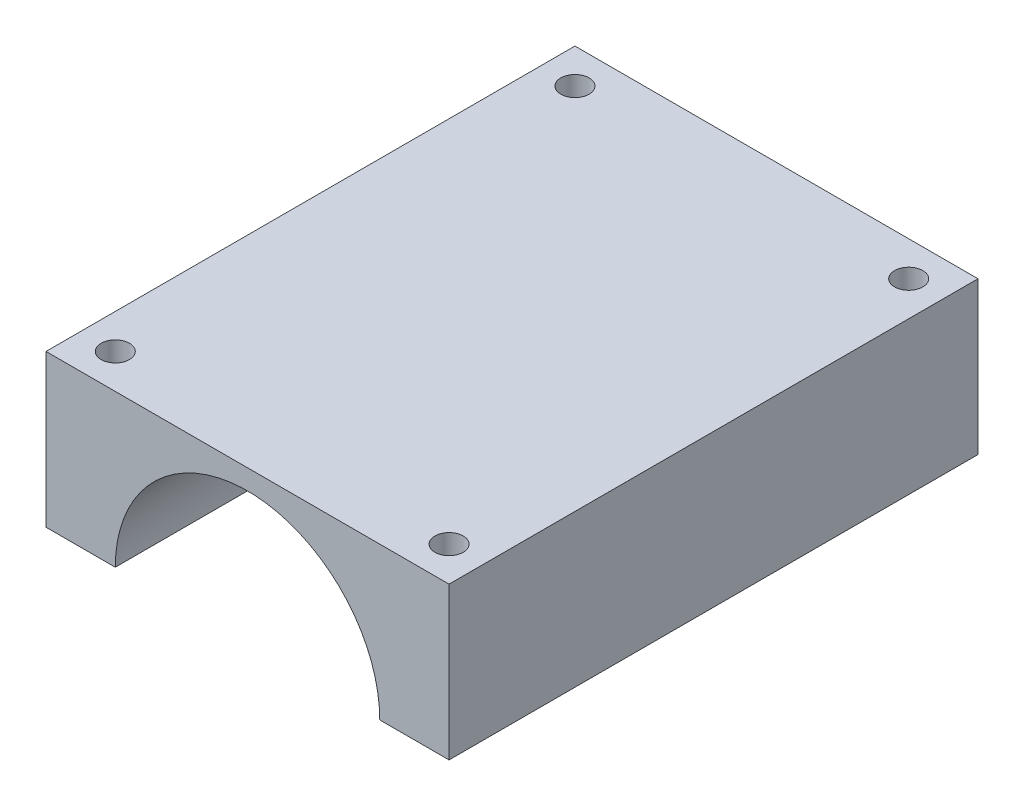
ISO-10303-21;
HEADER;
FILE_DESCRIPTION(('STEP AP214'),'2;1');
FILE_NAME('part.step','',(''),(''),'','','');
FILE_SCHEMA(('AUTOMOTIVE_DESIGN { 1 0 10303 214 1 1 1 1 }'));
ENDSEC;
DATA;
#1=APPLICATION_CONTEXT('core data for automotive mechanical design processes');
#2=APPLICATION_PROTOCOL_DEFINITION('international standard','automotive_design',2000,#1);
#3=PRODUCT_CONTEXT('',#1,'mechanical');
#4=PRODUCT('Part','Part','',(#3));
#5=PRODUCT_RELATED_PRODUCT_CATEGORY('part','',(#4));
#6=PRODUCT_DEFINITION_FORMATION('','',#4);
#7=PRODUCT_DEFINITION_CONTEXT('part definition',#1,'design');
#8=PRODUCT_DEFINITION('design','',#6,#7);
#9=PRODUCT_DEFINITION_SHAPE('','',#8);
#10=(LENGTH_UNIT() NAMED_UNIT(*) SI_UNIT(.MILLI.,.METRE.));
#11=(NAMED_UNIT(*) PLANE_ANGLE_UNIT() SI_UNIT($,.RADIAN.));
#12=(NAMED_UNIT(*) SI_UNIT($,.STERADIAN.) SOLID_ANGLE_UNIT());
#13=UNCERTAINTY_MEASURE_WITH_UNIT(LENGTH_MEASURE(1.E-05),#10,'distance_accuracy_value','');
#14=(GEOMETRIC_REPRESENTATION_CONTEXT(3) GLOBAL_UNCERTAINTY_ASSIGNED_CONTEXT((#13)) GLOBAL_UNIT_ASSIGNED_CONTEXT((#10,
#11,#12)) REPRESENTATION_CONTEXT('',''));
#15=CARTESIAN_POINT('',(0.,0.,0.));
#16=DIRECTION('',(0.,0.,1.));
#17=DIRECTION('',(1.,0.,0.));
#18=AXIS2_PLACEMENT_3D('',#15,#16,#17);
#19=CARTESIAN_POINT('',(0.,0.,0.));
#20=DIRECTION('',(0.,1.,0.));
#21=DIRECTION('',(0.,0.,1.));
#22=AXIS2_PLACEMENT_3D('',#19,#20,#21);
#23=PLANE('',#22);
#24=CARTESIAN_POINT('',(-23.6625,0.,-32.5875));
#25=DIRECTION('',(0.,1.,0.));
#26=DIRECTION('',(0.,0.,1.));
#27=AXIS2_PLACEMENT_3D('',#24,#25,#26);
#28=CIRCLE('',#27,2.008);
#29=CARTESIAN_POINT('',(-23.6625,0.,-30.5795));
#30=VERTEX_POINT('',#29);
#31=EDGE_CURVE('E180',#30,#30,#28,.T.);
#32=ORIENTED_EDGE('',*,*,#31,.T.);
#33=EDGE_LOOP('',(#32));
#34=FACE_BOUND('',#33,.T.);
#35=CARTESIAN_POINT('',(-23.6625,0.,32.5875));
#36=DIRECTION('',(0.,1.,0.));
#37=DIRECTION('',(0.,0.,1.));
#38=AXIS2_PLACEMENT_3D('',#35,#36,#37);
#39=CIRCLE('',#38,2.008);
#40=CARTESIAN_POINT('',(-23.6625,0.,34.5955));
#41=VERTEX_POINT('',#40);
#42=EDGE_CURVE('E109',#41,#41,#39,.F.);
#43=ORIENTED_EDGE('',*,*,#42,.F.);
#44=EDGE_LOOP('',(#43));
#45=FACE_BOUND('',#44,.T.);
#46=DIRECTION('',(-1.,0.,0.));
#47=VECTOR('',#46,1.);
#48=CARTESIAN_POINT('',(-28.575,0.,-37.5));
#49=LINE('',#48,#47);
#50=CARTESIAN_POINT('',(-18.75,0.,-37.5));
#51=VERTEX_POINT('',#50);
#52=CARTESIAN_POINT('',(-28.575,0.,-37.5));
#53=VERTEX_POINT('',#52);
#54=EDGE_CURVE('E81',#51,#53,#49,.T.);
#55=ORIENTED_EDGE('',*,*,#54,.F.);
#56=DIRECTION('',(0.,0.,1.));
#57=VECTOR('',#56,1.);
#58=CARTESIAN_POINT('',(-18.75,0.,-37.501));
#59=LINE('',#58,#57);
#60=CARTESIAN_POINT('',(-18.75,0.,37.5));
#61=VERTEX_POINT('',#60);
#62=EDGE_CURVE('E96',#51,#61,#59,.T.);
#63=ORIENTED_EDGE('',*,*,#62,.T.);
#64=DIRECTION('',(1.,0.,0.));
#65=VECTOR('',#64,1.);
#66=CARTESIAN_POINT('',(-28.575,0.,37.5));
#67=LINE('',#66,#65);
#68=CARTESIAN_POINT('',(-28.575,0.,37.5));
#69=VERTEX_POINT('',#68);
#70=EDGE_CURVE('E117',#69,#61,#67,.T.);
#71=ORIENTED_EDGE('',*,*,#70,.F.);
#72=DIRECTION('',(0.,0.,1.));
#73=VECTOR('',#72,1.);
#74=CARTESIAN_POINT('',(-28.575,0.,-37.5));
#75=LINE('',#74,#73);
#76=EDGE_CURVE('E113',#53,#69,#75,.T.);
#77=ORIENTED_EDGE('',*,*,#76,.F.);
#78=EDGE_LOOP('',(#55,#63,#71,#77));
#79=FACE_BOUND('',#78,.T.);
#80=ADVANCED_FACE('F37',(#34,#45,#79),#23,.F.);
#81=CARTESIAN_POINT('',(-28.575,21.59,-37.5));
#82=DIRECTION('',(1.,0.,0.));
#83=DIRECTION('',(0.,0.,-1.));
#84=AXIS2_PLACEMENT_3D('',#81,#82,#83);
#85=PLANE('',#84);
#86=ORIENTED_EDGE('',*,*,#76,.T.);
#87=DIRECTION('',(0.,-1.,0.));
#88=VECTOR('',#87,1.);
#89=CARTESIAN_POINT('',(-28.575,21.59,37.5));
#90=LINE('',#89,#88);
#91=CARTESIAN_POINT('',(-28.575,21.59,37.5));
#92=VERTEX_POINT('',#91);
#93=EDGE_CURVE('E11',#92,#69,#90,.T.);
#94=ORIENTED_EDGE('',*,*,#93,.F.);
#95=DIRECTION('',(0.,0.,1.));
#96=VECTOR('',#95,1.);
#97=CARTESIAN_POINT('',(-28.575,21.59,-37.5));
#98=LINE('',#97,#96);
#99=CARTESIAN_POINT('',(-28.575,21.59,-37.5));
#100=VERTEX_POINT('',#99);
#101=EDGE_CURVE('E116',#100,#92,#98,.T.);
#102=ORIENTED_EDGE('',*,*,#101,.F.);
#103=DIRECTION('',(0.,-1.,0.));
#104=VECTOR('',#103,1.);
#105=CARTESIAN_POINT('',(-28.575,21.59,-37.5));
#106=LINE('',#105,#104);
#107=EDGE_CURVE('E121',#100,#53,#106,.T.);
#108=ORIENTED_EDGE('',*,*,#107,.T.);
#109=EDGE_LOOP('',(#86,#94,#102,#108));
#110=FACE_BOUND('',#109,.T.);
#111=ADVANCED_FACE('F39',(#110),#85,.F.);
#112=CARTESIAN_POINT('',(-28.575,21.59,37.5));
#113=DIRECTION('',(0.,0.,-1.));
#114=DIRECTION('',(-1.,0.,0.));
#115=AXIS2_PLACEMENT_3D('',#112,#113,#114);
#116=PLANE('',#115);
#117=ORIENTED_EDGE('',*,*,#70,.T.);
#118=CARTESIAN_POINT('',(0.,0.,37.5));
#119=DIRECTION('',(0.,0.,1.));
#120=DIRECTION('',(-1.,0.,0.));
#121=AXIS2_PLACEMENT_3D('',#118,#119,#120);
#122=CIRCLE('',#121,18.75);
#123=CARTESIAN_POINT('',(18.75,0.,37.5));
#124=VERTEX_POINT('',#123);
#125=EDGE_CURVE('E99',#124,#61,#122,.T.);
#126=ORIENTED_EDGE('',*,*,#125,.F.);
#127=CARTESIAN_POINT('',(28.575,0.,37.5));
#128=VERTEX_POINT('',#127);
#129=EDGE_CURVE('E134',#124,#128,#67,.T.);
#130=ORIENTED_EDGE('',*,*,#129,.T.);
#131=DIRECTION('',(0.,-1.,0.));
#132=VECTOR('',#131,1.);
#133=CARTESIAN_POINT('',(28.575,21.59,37.5));
#134=LINE('',#133,#132);
#135=CARTESIAN_POINT('',(28.575,21.59,37.5));
#136=VERTEX_POINT('',#135);
#137=EDGE_CURVE('E45',#136,#128,#134,.T.);
#138=ORIENTED_EDGE('',*,*,#137,.F.);
#139=DIRECTION('',(1.,0.,0.));
#140=VECTOR('',#139,1.);
#141=CARTESIAN_POINT('',(-28.575,21.59,37.5));
#142=LINE('',#141,#140);
#143=EDGE_CURVE('E88',#92,#136,#142,.T.);
#144=ORIENTED_EDGE('',*,*,#143,.F.);
#145=ORIENTED_EDGE('',*,*,#93,.T.);
#146=EDGE_LOOP('',(#117,#126,#130,#138,#144,#145));
#147=FACE_BOUND('',#146,.T.);
#148=ADVANCED_FACE('F142',(#147),#116,.F.);
#149=CARTESIAN_POINT('',(28.575,21.59,-37.5));
#150=DIRECTION('',(-1.,0.,0.));
#151=DIRECTION('',(0.,0.,1.));
#152=AXIS2_PLACEMENT_3D('',#149,#150,#151);
#153=PLANE('',#152);
#154=DIRECTION('',(0.,0.,-1.));
#155=VECTOR('',#154,1.);
#156=CARTESIAN_POINT('',(28.575,0.,-37.5));
#157=LINE('',#156,#155);
#158=CARTESIAN_POINT('',(28.575,0.,-37.5));
#159=VERTEX_POINT('',#158);
#160=EDGE_CURVE('E114',#128,#159,#157,.T.);
#161=ORIENTED_EDGE('',*,*,#160,.T.);
#162=DIRECTION('',(0.,-1.,0.));
#163=VECTOR('',#162,1.);
#164=CARTESIAN_POINT('',(28.575,21.59,-37.5));
#165=LINE('',#164,#163);
#166=CARTESIAN_POINT('',(28.575,21.59,-37.5));
#167=VERTEX_POINT('',#166);
#168=EDGE_CURVE('E123',#167,#159,#165,.T.);
#169=ORIENTED_EDGE('',*,*,#168,.F.);
#170=DIRECTION('',(0.,0.,-1.));
#171=VECTOR('',#170,1.);
#172=CARTESIAN_POINT('',(28.575,21.59,-37.5));
#173=LINE('',#172,#171);
#174=EDGE_CURVE('E130',#136,#167,#173,.T.);
#175=ORIENTED_EDGE('',*,*,#174,.F.);
#176=ORIENTED_EDGE('',*,*,#137,.T.);
#177=EDGE_LOOP('',(#161,#169,#175,#176));
#178=FACE_BOUND('',#177,.T.);
#179=ADVANCED_FACE('F128',(#178),#153,.F.);
#180=CARTESIAN_POINT('',(-28.575,21.59,-37.5));
#181=DIRECTION('',(0.,0.,1.));
#182=DIRECTION('',(1.,0.,0.));
#183=AXIS2_PLACEMENT_3D('',#180,#181,#182);
#184=PLANE('',#183);
#185=CARTESIAN_POINT('',(18.75,0.,-37.5));
#186=VERTEX_POINT('',#185);
#187=EDGE_CURVE('E108',#159,#186,#49,.T.);
#188=ORIENTED_EDGE('',*,*,#187,.T.);
#189=CARTESIAN_POINT('',(0.,0.,-37.5));
#190=DIRECTION('',(0.,0.,1.));
#191=DIRECTION('',(1.,0.,0.));
#192=AXIS2_PLACEMENT_3D('',#189,#190,#191);
#193=CIRCLE('',#192,18.75);
#194=EDGE_CURVE('E52',#51,#186,#193,.F.);
#195=ORIENTED_EDGE('',*,*,#194,.F.);
#196=ORIENTED_EDGE('',*,*,#54,.T.);
#197=ORIENTED_EDGE('',*,*,#107,.F.);
#198=DIRECTION('',(-1.,0.,0.));
#199=VECTOR('',#198,1.);
#200=CARTESIAN_POINT('',(-28.575,21.59,-37.5));
#201=LINE('',#200,#199);
#202=EDGE_CURVE('E61',#167,#100,#201,.T.);
#203=ORIENTED_EDGE('',*,*,#202,.F.);
#204=ORIENTED_EDGE('',*,*,#168,.T.);
#205=EDGE_LOOP('',(#188,#195,#196,#197,#203,#204));
#206=FACE_BOUND('',#205,.T.);
#207=ADVANCED_FACE('F105',(#206),#184,.F.);
#208=CARTESIAN_POINT('',(0.,21.59,0.));
#209=DIRECTION('',(0.,1.,0.));
#210=DIRECTION('',(0.,0.,1.));
#211=AXIS2_PLACEMENT_3D('',#208,#209,#210);
#212=PLANE('',#211);
#213=CARTESIAN_POINT('',(23.6625,21.59,-32.5875));
#214=DIRECTION('',(0.,1.,0.));
#215=DIRECTION('',(0.,0.,-1.));
#216=AXIS2_PLACEMENT_3D('',#213,#214,#215);
#217=CIRCLE('',#216,2.008);
#218=CARTESIAN_POINT('',(23.6625,21.59,-34.5955));
#219=VERTEX_POINT('',#218);
#220=EDGE_CURVE('E182',#219,#219,#217,.T.);
#221=ORIENTED_EDGE('',*,*,#220,.F.);
#222=EDGE_LOOP('',(#221));
#223=FACE_BOUND('',#222,.T.);
#224=CARTESIAN_POINT('',(23.6625,21.59,32.5875));
#225=DIRECTION('',(0.,-1.,0.));
#226=DIRECTION('',(0.,0.,1.));
#227=AXIS2_PLACEMENT_3D('',#224,#225,#226);
#228=CIRCLE('',#227,2.008);
#229=CARTESIAN_POINT('',(23.6625,21.59,34.5955));
#230=VERTEX_POINT('',#229);
#231=EDGE_CURVE('E177',#230,#230,#228,.T.);
#232=ORIENTED_EDGE('',*,*,#231,.T.);
#233=EDGE_LOOP('',(#232));
#234=FACE_BOUND('',#233,.T.);
#235=CARTESIAN_POINT('',(-23.6625,21.59,-32.5875));
#236=DIRECTION('',(0.,-1.,0.));
#237=DIRECTION('',(0.,0.,-1.));
#238=AXIS2_PLACEMENT_3D('',#235,#236,#237);
#239=CIRCLE('',#238,2.008);
#240=CARTESIAN_POINT('',(-23.6625,21.59,-34.5955));
#241=VERTEX_POINT('',#240);
#242=EDGE_CURVE('E185',#241,#241,#239,.T.);
#243=ORIENTED_EDGE('',*,*,#242,.T.);
#244=EDGE_LOOP('',(#243));
#245=FACE_BOUND('',#244,.T.);
#246=CARTESIAN_POINT('',(-23.6625,21.59,32.5875));
#247=DIRECTION('',(0.,1.,0.));
#248=DIRECTION('',(0.,0.,1.));
#249=AXIS2_PLACEMENT_3D('',#246,#247,#248);
#250=CIRCLE('',#249,2.008);
#251=CARTESIAN_POINT('',(-23.6625,21.59,34.5955));
#252=VERTEX_POINT('',#251);
#253=EDGE_CURVE('E188',#252,#252,#250,.T.);
#254=ORIENTED_EDGE('',*,*,#253,.F.);
#255=EDGE_LOOP('',(#254));
#256=FACE_BOUND('',#255,.T.);
#257=ORIENTED_EDGE('',*,*,#101,.T.);
#258=ORIENTED_EDGE('',*,*,#143,.T.);
#259=ORIENTED_EDGE('',*,*,#174,.T.);
#260=ORIENTED_EDGE('',*,*,#202,.T.);
#261=EDGE_LOOP('',(#257,#258,#259,#260));
#262=FACE_BOUND('',#261,.T.);
#263=ADVANCED_FACE('F160',(#223,#234,#245,#256,#262),#212,.T.);
#264=CARTESIAN_POINT('',(23.6625,0.,-32.5875));
#265=DIRECTION('',(0.,1.,0.));
#266=DIRECTION('',(0.,0.,1.));
#267=AXIS2_PLACEMENT_3D('',#264,#265,#266);
#268=CIRCLE('',#267,2.008);
#269=CARTESIAN_POINT('',(23.6625,0.,-30.5795));
#270=VERTEX_POINT('',#269);
#271=EDGE_CURVE('E172',#270,#270,#268,.F.);
#272=ORIENTED_EDGE('',*,*,#271,.F.);
#273=EDGE_LOOP('',(#272));
#274=FACE_BOUND('',#273,.T.);
#275=CARTESIAN_POINT('',(23.6625,0.,32.5875));
#276=DIRECTION('',(0.,1.,0.));
#277=DIRECTION('',(0.,0.,1.));
#278=AXIS2_PLACEMENT_3D('',#275,#276,#277);
#279=CIRCLE('',#278,2.008);
#280=CARTESIAN_POINT('',(23.6625,0.,34.5955));
#281=VERTEX_POINT('',#280);
#282=EDGE_CURVE('E175',#281,#281,#279,.T.);
#283=ORIENTED_EDGE('',*,*,#282,.T.);
#284=EDGE_LOOP('',(#283));
#285=FACE_BOUND('',#284,.T.);
#286=ORIENTED_EDGE('',*,*,#129,.F.);
#287=DIRECTION('',(0.,0.,1.));
#288=VECTOR('',#287,1.);
#289=CARTESIAN_POINT('',(18.75,0.,-37.501));
#290=LINE('',#289,#288);
#291=EDGE_CURVE('E102',#186,#124,#290,.T.);
#292=ORIENTED_EDGE('',*,*,#291,.F.);
#293=ORIENTED_EDGE('',*,*,#187,.F.);
#294=ORIENTED_EDGE('',*,*,#160,.F.);
#295=EDGE_LOOP('',(#286,#292,#293,#294));
#296=FACE_BOUND('',#295,.T.);
#297=ADVANCED_FACE('F133',(#274,#285,#296),#23,.F.);
#298=CARTESIAN_POINT('',(0.,0.,-37.501));
#299=DIRECTION('',(0.,0.,1.));
#300=DIRECTION('',(1.,0.,0.));
#301=AXIS2_PLACEMENT_3D('',#298,#299,#300);
#302=CYLINDRICAL_SURFACE('',#301,18.75);
#303=ORIENTED_EDGE('',*,*,#194,.T.);
#304=ORIENTED_EDGE('',*,*,#291,.T.);
#305=ORIENTED_EDGE('',*,*,#125,.T.);
#306=ORIENTED_EDGE('',*,*,#62,.F.);
#307=EDGE_LOOP('',(#303,#304,#305,#306));
#308=FACE_BOUND('',#307,.T.);
#309=ADVANCED_FACE('F97',(#308),#302,.F.);
#310=CARTESIAN_POINT('',(-23.6625,-0.001000000000001,32.5875));
#311=DIRECTION('',(0.,1.,0.));
#312=DIRECTION('',(0.,0.,1.));
#313=AXIS2_PLACEMENT_3D('',#310,#311,#312);
#314=CYLINDRICAL_SURFACE('',#313,2.008);
#315=ORIENTED_EDGE('',*,*,#253,.T.);
#316=EDGE_LOOP('',(#315));
#317=FACE_BOUND('',#316,.T.);
#318=ORIENTED_EDGE('',*,*,#42,.T.);
#319=EDGE_LOOP('',(#318));
#320=FACE_BOUND('',#319,.T.);
#321=ADVANCED_FACE('F166',(#317,#320),#314,.F.);
#322=CARTESIAN_POINT('',(-23.6625,-0.001000000000001,-32.5875));
#323=DIRECTION('',(0.,1.,0.));
#324=DIRECTION('',(0.,0.,1.));
#325=AXIS2_PLACEMENT_3D('',#322,#323,#324);
#326=CYLINDRICAL_SURFACE('',#325,2.008);
#327=ORIENTED_EDGE('',*,*,#242,.F.);
#328=EDGE_LOOP('',(#327));
#329=FACE_BOUND('',#328,.T.);
#330=ORIENTED_EDGE('',*,*,#31,.F.);
#331=EDGE_LOOP('',(#330));
#332=FACE_BOUND('',#331,.T.);
#333=ADVANCED_FACE('F196',(#329,#332),#326,.F.);
#334=CARTESIAN_POINT('',(23.6625,-0.001000000000001,32.5875));
#335=DIRECTION('',(0.,1.,0.));
#336=DIRECTION('',(0.,0.,1.));
#337=AXIS2_PLACEMENT_3D('',#334,#335,#336);
#338=CYLINDRICAL_SURFACE('',#337,2.008);
#339=ORIENTED_EDGE('',*,*,#231,.F.);
#340=EDGE_LOOP('',(#339));
#341=FACE_BOUND('',#340,.T.);
#342=ORIENTED_EDGE('',*,*,#282,.F.);
#343=EDGE_LOOP('',(#342));
#344=FACE_BOUND('',#343,.T.);
#345=ADVANCED_FACE('F202',(#341,#344),#338,.F.);
#346=CARTESIAN_POINT('',(23.6625,-0.001000000000001,-32.5875));
#347=DIRECTION('',(0.,1.,0.));
#348=DIRECTION('',(0.,0.,1.));
#349=AXIS2_PLACEMENT_3D('',#346,#347,#348);
#350=CYLINDRICAL_SURFACE('',#349,2.008);
#351=ORIENTED_EDGE('',*,*,#220,.T.);
#352=EDGE_LOOP('',(#351));
#353=FACE_BOUND('',#352,.T.);
#354=ORIENTED_EDGE('',*,*,#271,.T.);
#355=EDGE_LOOP('',(#354));
#356=FACE_BOUND('',#355,.T.);
#357=ADVANCED_FACE('F208',(#353,#356),#350,.F.);
#358=CLOSED_SHELL('',(#80,#111,#148,#179,#207,#263,#297,#309,#321,#333,#345,#357));
#359=MANIFOLD_SOLID_BREP('B2',#358);
#360=ADVANCED_BREP_SHAPE_REPRESENTATION('',(#18,#359),#14);
#361=SHAPE_DEFINITION_REPRESENTATION(#9,#360);
ENDSEC;
END-ISO-10303-21;
